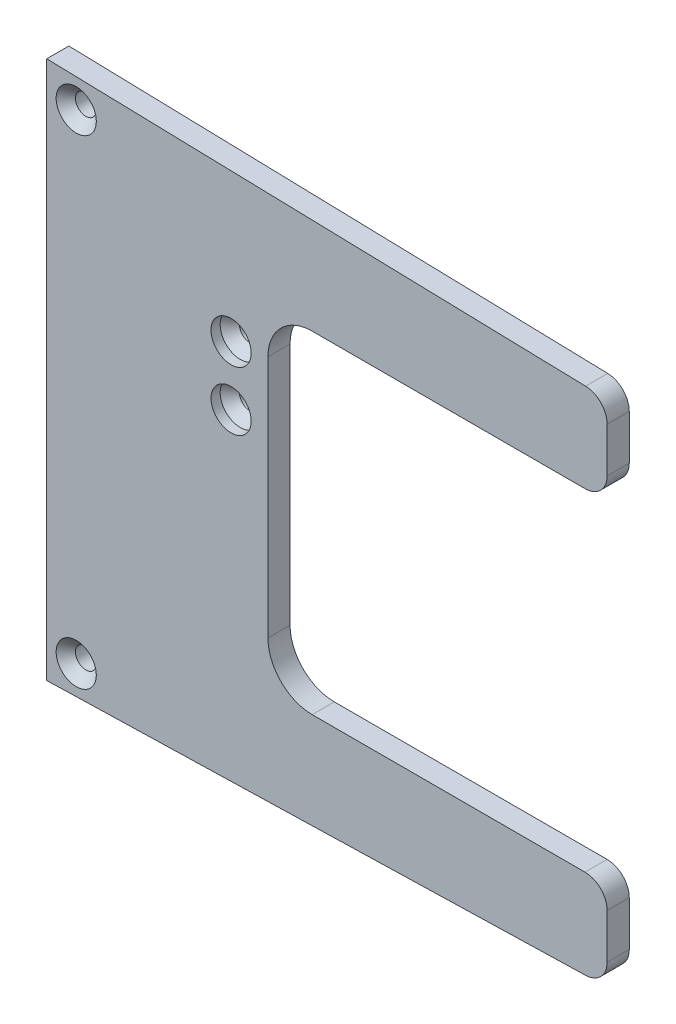
ISO-10303-21;
HEADER;
FILE_DESCRIPTION(('STEP AP214'),'2;1');
FILE_NAME('part.step','',(''),(''),'','','');
FILE_SCHEMA(('AUTOMOTIVE_DESIGN { 1 0 10303 214 1 1 1 1 }'));
ENDSEC;
DATA;
#1=APPLICATION_CONTEXT('core data for automotive mechanical design processes');
#2=APPLICATION_PROTOCOL_DEFINITION('international standard','automotive_design',2000,#1);
#3=PRODUCT_CONTEXT('',#1,'mechanical');
#4=PRODUCT('Part','Part','',(#3));
#5=PRODUCT_RELATED_PRODUCT_CATEGORY('part','',(#4));
#6=PRODUCT_DEFINITION_FORMATION('','',#4);
#7=PRODUCT_DEFINITION_CONTEXT('part definition',#1,'design');
#8=PRODUCT_DEFINITION('design','',#6,#7);
#9=PRODUCT_DEFINITION_SHAPE('','',#8);
#10=(LENGTH_UNIT() NAMED_UNIT(*) SI_UNIT(.MILLI.,.METRE.));
#11=(NAMED_UNIT(*) PLANE_ANGLE_UNIT() SI_UNIT($,.RADIAN.));
#12=(NAMED_UNIT(*) SI_UNIT($,.STERADIAN.) SOLID_ANGLE_UNIT());
#13=UNCERTAINTY_MEASURE_WITH_UNIT(LENGTH_MEASURE(1.E-05),#10,'distance_accuracy_value','');
#14=(GEOMETRIC_REPRESENTATION_CONTEXT(3) GLOBAL_UNCERTAINTY_ASSIGNED_CONTEXT((#13)) GLOBAL_UNIT_ASSIGNED_CONTEXT((#10,
#11,#12)) REPRESENTATION_CONTEXT('',''));
#15=CARTESIAN_POINT('',(0.,0.,0.));
#16=DIRECTION('',(0.,0.,1.));
#17=DIRECTION('',(1.,0.,0.));
#18=AXIS2_PLACEMENT_3D('',#15,#16,#17);
#19=CARTESIAN_POINT('',(-47.625,-115.91925,9.525));
#20=DIRECTION('',(1.,0.,0.));
#21=DIRECTION('',(0.,-1.,0.));
#22=AXIS2_PLACEMENT_3D('',#19,#20,#21);
#23=PLANE('',#22);
#24=DIRECTION('',(0.,1.,0.));
#25=VECTOR('',#24,1.);
#26=CARTESIAN_POINT('',(-47.625,-115.91925,0.));
#27=LINE('',#26,#25);
#28=CARTESIAN_POINT('',(-47.625,-115.91925,0.));
#29=VERTEX_POINT('',#28);
#30=CARTESIAN_POINT('',(-47.625,115.91925,0.));
#31=VERTEX_POINT('',#30);
#32=EDGE_CURVE('E168',#29,#31,#27,.T.);
#33=ORIENTED_EDGE('',*,*,#32,.F.);
#34=DIRECTION('',(0.,0.,-1.));
#35=VECTOR('',#34,1.);
#36=CARTESIAN_POINT('',(-47.625,-115.91925,9.525));
#37=LINE('',#36,#35);
#38=CARTESIAN_POINT('',(-47.625,-115.91925,9.525));
#39=VERTEX_POINT('',#38);
#40=EDGE_CURVE('E159',#39,#29,#37,.T.);
#41=ORIENTED_EDGE('',*,*,#40,.F.);
#42=DIRECTION('',(0.,1.,0.));
#43=VECTOR('',#42,1.);
#44=CARTESIAN_POINT('',(-47.625,-115.91925,9.525));
#45=LINE('',#44,#43);
#46=CARTESIAN_POINT('',(-47.625,115.91925,9.525));
#47=VERTEX_POINT('',#46);
#48=EDGE_CURVE('E142',#39,#47,#45,.T.);
#49=ORIENTED_EDGE('',*,*,#48,.T.);
#50=DIRECTION('',(0.,0.,-1.));
#51=VECTOR('',#50,1.);
#52=CARTESIAN_POINT('',(-47.625,115.91925,9.525));
#53=LINE('',#52,#51);
#54=EDGE_CURVE('E152',#47,#31,#53,.T.);
#55=ORIENTED_EDGE('',*,*,#54,.T.);
#56=EDGE_LOOP('',(#33,#41,#49,#55));
#57=FACE_BOUND('',#56,.T.);
#58=ADVANCED_FACE('F37',(#57),#23,.F.);
#59=CARTESIAN_POINT('',(47.625,-115.91925,9.525));
#60=DIRECTION('',(-1.,0.,0.));
#61=DIRECTION('',(0.,1.,0.));
#62=AXIS2_PLACEMENT_3D('',#59,#60,#61);
#63=PLANE('',#62);
#64=DIRECTION('',(0.,-1.,0.));
#65=VECTOR('',#64,1.);
#66=CARTESIAN_POINT('',(47.625,-115.91925,9.525));
#67=LINE('',#66,#65);
#68=CARTESIAN_POINT('',(47.625,52.4505871253568,9.525));
#69=VERTEX_POINT('',#68);
#70=CARTESIAN_POINT('',(47.625,-52.4505871253569,9.525));
#71=VERTEX_POINT('',#70);
#72=EDGE_CURVE('E162',#69,#71,#67,.T.);
#73=ORIENTED_EDGE('',*,*,#72,.T.);
#74=DIRECTION('',(0.,0.,1.));
#75=VECTOR('',#74,1.);
#76=CARTESIAN_POINT('',(47.625,-52.4505871253569,9.525));
#77=LINE('',#76,#75);
#78=CARTESIAN_POINT('',(47.625,-52.4505871253569,0.));
#79=VERTEX_POINT('',#78);
#80=EDGE_CURVE('E215',#79,#71,#77,.T.);
#81=ORIENTED_EDGE('',*,*,#80,.F.);
#82=DIRECTION('',(0.,-1.,0.));
#83=VECTOR('',#82,1.);
#84=CARTESIAN_POINT('',(47.625,-115.91925,0.));
#85=LINE('',#84,#83);
#86=CARTESIAN_POINT('',(47.625,52.4505871253568,0.));
#87=VERTEX_POINT('',#86);
#88=EDGE_CURVE('E163',#87,#79,#85,.T.);
#89=ORIENTED_EDGE('',*,*,#88,.F.);
#90=DIRECTION('',(0.,0.,1.));
#91=VECTOR('',#90,1.);
#92=CARTESIAN_POINT('',(47.625,52.4505871253569,9.525));
#93=LINE('',#92,#91);
#94=EDGE_CURVE('E218',#69,#87,#93,.F.);
#95=ORIENTED_EDGE('',*,*,#94,.F.);
#96=EDGE_LOOP('',(#73,#81,#89,#95));
#97=FACE_BOUND('',#96,.T.);
#98=ADVANCED_FACE('F309',(#97),#63,.F.);
#99=CARTESIAN_POINT('',(-47.625,115.91925,9.525));
#100=DIRECTION('',(0.,0.,1.));
#101=DIRECTION('',(1.,0.,0.));
#102=AXIS2_PLACEMENT_3D('',#99,#100,#101);
#103=PLANE('',#102);
#104=DIRECTION('',(-0.999657324975558,0.0261769483078661,0.));
#105=VECTOR('',#104,1.);
#106=CARTESIAN_POINT('',(47.625,113.425040970536,9.525));
#107=LINE('',#106,#105);
#108=CARTESIAN_POINT('',(184.399335432632,109.84347895022,9.525));
#109=VERTEX_POINT('',#108);
#110=EDGE_CURVE('E136',#109,#47,#107,.T.);
#111=ORIENTED_EDGE('',*,*,#110,.T.);
#112=ORIENTED_EDGE('',*,*,#48,.F.);
#113=DIRECTION('',(0.999657324975557,0.026176948307866,0.));
#114=VECTOR('',#113,1.);
#115=CARTESIAN_POINT('',(-47.625,-115.91925,9.525));
#116=LINE('',#115,#114);
#117=CARTESIAN_POINT('',(184.399335432632,-109.84347895022,9.525));
#118=VERTEX_POINT('',#117);
#119=EDGE_CURVE('E148',#39,#118,#116,.T.);
#120=ORIENTED_EDGE('',*,*,#119,.T.);
#121=CARTESIAN_POINT('',(184.15,-100.321742929828,9.52500000000001));
#122=DIRECTION('',(0.,0.,-1.));
#123=DIRECTION('',(1.,0.,0.));
#124=AXIS2_PLACEMENT_3D('',#121,#122,#123);
#125=CIRCLE('',#124,9.525);
#126=CARTESIAN_POINT('',(193.675,-100.321742929828,9.525));
#127=VERTEX_POINT('',#126);
#128=EDGE_CURVE('E177',#127,#118,#125,.T.);
#129=ORIENTED_EDGE('',*,*,#128,.F.);
#130=DIRECTION('',(0.,-1.,0.));
#131=VECTOR('',#130,1.);
#132=CARTESIAN_POINT('',(193.675,-109.600587125357,9.525));
#133=LINE('',#132,#131);
#134=CARTESIAN_POINT('',(193.675,-81.0255871253569,9.525));
#135=VERTEX_POINT('',#134);
#136=EDGE_CURVE('E232',#135,#127,#133,.T.);
#137=ORIENTED_EDGE('',*,*,#136,.F.);
#138=CARTESIAN_POINT('',(184.15,-81.0255871253569,9.52500000000001));
#139=DIRECTION('',(0.,0.,-1.));
#140=DIRECTION('',(1.,0.,0.));
#141=AXIS2_PLACEMENT_3D('',#138,#139,#140);
#142=CIRCLE('',#141,9.525);
#143=CARTESIAN_POINT('',(184.15,-71.5005871253569,9.525));
#144=VERTEX_POINT('',#143);
#145=EDGE_CURVE('E180',#144,#135,#142,.T.);
#146=ORIENTED_EDGE('',*,*,#145,.F.);
#147=DIRECTION('',(1.,0.,0.));
#148=VECTOR('',#147,1.);
#149=CARTESIAN_POINT('',(193.675,-71.5005871253569,9.525));
#150=LINE('',#149,#148);
#151=CARTESIAN_POINT('',(66.675,-71.5005871253569,9.525));
#152=VERTEX_POINT('',#151);
#153=EDGE_CURVE('E230',#152,#144,#150,.T.);
#154=ORIENTED_EDGE('',*,*,#153,.F.);
#155=CARTESIAN_POINT('',(66.675,-52.4505871253569,9.525));
#156=DIRECTION('',(0.,0.,-1.));
#157=DIRECTION('',(1.,0.,0.));
#158=AXIS2_PLACEMENT_3D('',#155,#156,#157);
#159=CIRCLE('',#158,19.05);
#160=EDGE_CURVE('E45',#71,#152,#159,.F.);
#161=ORIENTED_EDGE('',*,*,#160,.F.);
#162=ORIENTED_EDGE('',*,*,#72,.F.);
#163=CARTESIAN_POINT('',(66.675,52.4505871253569,9.52500000000001));
#164=DIRECTION('',(0.,0.,-1.));
#165=DIRECTION('',(1.,0.,0.));
#166=AXIS2_PLACEMENT_3D('',#163,#164,#165);
#167=CIRCLE('',#166,19.05);
#168=CARTESIAN_POINT('',(66.675,71.5005871253569,9.525));
#169=VERTEX_POINT('',#168);
#170=EDGE_CURVE('E222',#169,#69,#167,.F.);
#171=ORIENTED_EDGE('',*,*,#170,.F.);
#172=DIRECTION('',(-1.,0.,0.));
#173=VECTOR('',#172,1.);
#174=CARTESIAN_POINT('',(47.625,71.5005871253569,9.525));
#175=LINE('',#174,#173);
#176=CARTESIAN_POINT('',(184.15,71.5005871253569,9.525));
#177=VERTEX_POINT('',#176);
#178=EDGE_CURVE('E349',#177,#169,#175,.T.);
#179=ORIENTED_EDGE('',*,*,#178,.F.);
#180=CARTESIAN_POINT('',(184.15,81.0255871253569,9.52500000000001));
#181=DIRECTION('',(0.,0.,-1.));
#182=DIRECTION('',(1.,0.,0.));
#183=AXIS2_PLACEMENT_3D('',#180,#181,#182);
#184=CIRCLE('',#183,9.525);
#185=CARTESIAN_POINT('',(193.675,81.0255871253569,9.525));
#186=VERTEX_POINT('',#185);
#187=EDGE_CURVE('E183',#186,#177,#184,.T.);
#188=ORIENTED_EDGE('',*,*,#187,.F.);
#189=DIRECTION('',(0.,-1.,0.));
#190=VECTOR('',#189,1.);
#191=CARTESIAN_POINT('',(193.675,71.5005871253569,9.525));
#192=LINE('',#191,#190);
#193=CARTESIAN_POINT('',(193.675,100.321742929828,9.525));
#194=VERTEX_POINT('',#193);
#195=EDGE_CURVE('E352',#194,#186,#192,.T.);
#196=ORIENTED_EDGE('',*,*,#195,.F.);
#197=CARTESIAN_POINT('',(184.15,100.321742929828,9.525));
#198=DIRECTION('',(0.,0.,-1.));
#199=DIRECTION('',(1.,0.,0.));
#200=AXIS2_PLACEMENT_3D('',#197,#198,#199);
#201=CIRCLE('',#200,9.525);
#202=EDGE_CURVE('E146',#109,#194,#201,.T.);
#203=ORIENTED_EDGE('',*,*,#202,.F.);
#204=EDGE_LOOP('',(#111,#112,#120,#129,#137,#146,#154,#161,#162,#171,#179,#188,#196,#203));
#205=FACE_BOUND('',#204,.T.);
#206=CARTESIAN_POINT('',(-34.925,-103.21925,9.525));
#207=DIRECTION('',(0.,0.,-1.));
#208=DIRECTION('',(1.,0.,0.));
#209=AXIS2_PLACEMENT_3D('',#206,#207,#208);
#210=CIRCLE('',#209,8.65);
#211=CARTESIAN_POINT('',(-26.275,-103.21925,9.525));
#212=VERTEX_POINT('',#211);
#213=EDGE_CURVE('E250',#212,#212,#210,.T.);
#214=ORIENTED_EDGE('',*,*,#213,.T.);
#215=EDGE_LOOP('',(#214));
#216=FACE_BOUND('',#215,.T.);
#217=CARTESIAN_POINT('',(-34.925,103.21925,9.525));
#218=DIRECTION('',(0.,0.,-1.));
#219=DIRECTION('',(1.,0.,0.));
#220=AXIS2_PLACEMENT_3D('',#217,#218,#219);
#221=CIRCLE('',#220,8.65);
#222=CARTESIAN_POINT('',(-26.275,103.21925,9.525));
#223=VERTEX_POINT('',#222);
#224=EDGE_CURVE('E259',#223,#223,#221,.T.);
#225=ORIENTED_EDGE('',*,*,#224,.T.);
#226=EDGE_LOOP('',(#225));
#227=FACE_BOUND('',#226,.T.);
#228=CARTESIAN_POINT('',(31.75,50.15865,9.525));
#229=DIRECTION('',(0.,0.,-1.));
#230=DIRECTION('',(1.,0.,0.));
#231=AXIS2_PLACEMENT_3D('',#228,#229,#230);
#232=CIRCLE('',#231,8.65);
#233=CARTESIAN_POINT('',(40.4,50.15865,9.525));
#234=VERTEX_POINT('',#233);
#235=EDGE_CURVE('E277',#234,#234,#232,.T.);
#236=ORIENTED_EDGE('',*,*,#235,.T.);
#237=EDGE_LOOP('',(#236));
#238=FACE_BOUND('',#237,.T.);
#239=CARTESIAN_POINT('',(31.75,24.75865,9.525));
#240=DIRECTION('',(0.,0.,-1.));
#241=DIRECTION('',(1.,0.,0.));
#242=AXIS2_PLACEMENT_3D('',#239,#240,#241);
#243=CIRCLE('',#242,8.65);
#244=CARTESIAN_POINT('',(40.4,24.75865,9.525));
#245=VERTEX_POINT('',#244);
#246=EDGE_CURVE('E171',#245,#245,#243,.T.);
#247=ORIENTED_EDGE('',*,*,#246,.T.);
#248=EDGE_LOOP('',(#247));
#249=FACE_BOUND('',#248,.T.);
#250=ADVANCED_FACE('F138',(#205,#216,#227,#238,#249),#103,.T.);
#251=CARTESIAN_POINT('',(-47.625,115.91925,0.));
#252=DIRECTION('',(0.,0.,1.));
#253=DIRECTION('',(1.,0.,0.));
#254=AXIS2_PLACEMENT_3D('',#251,#252,#253);
#255=PLANE('',#254);
#256=CARTESIAN_POINT('',(-34.925,-103.21925,0.));
#257=DIRECTION('',(0.,0.,-1.));
#258=DIRECTION('',(1.,0.,0.));
#259=AXIS2_PLACEMENT_3D('',#256,#257,#258);
#260=CIRCLE('',#259,4.49999999999999);
#261=CARTESIAN_POINT('',(-30.425,-103.21925,0.));
#262=VERTEX_POINT('',#261);
#263=EDGE_CURVE('E256',#262,#262,#260,.T.);
#264=ORIENTED_EDGE('',*,*,#263,.F.);
#265=EDGE_LOOP('',(#264));
#266=FACE_BOUND('',#265,.T.);
#267=CARTESIAN_POINT('',(-34.925,103.21925,0.));
#268=DIRECTION('',(0.,0.,-1.));
#269=DIRECTION('',(1.,0.,0.));
#270=AXIS2_PLACEMENT_3D('',#267,#268,#269);
#271=CIRCLE('',#270,4.49999999999999);
#272=CARTESIAN_POINT('',(-30.425,103.21925,0.));
#273=VERTEX_POINT('',#272);
#274=EDGE_CURVE('E265',#273,#273,#271,.T.);
#275=ORIENTED_EDGE('',*,*,#274,.F.);
#276=EDGE_LOOP('',(#275));
#277=FACE_BOUND('',#276,.T.);
#278=CARTESIAN_POINT('',(31.75,50.15865,0.));
#279=DIRECTION('',(0.,0.,-1.));
#280=DIRECTION('',(1.,0.,0.));
#281=AXIS2_PLACEMENT_3D('',#278,#279,#280);
#282=CIRCLE('',#281,4.5);
#283=CARTESIAN_POINT('',(36.25,50.15865,0.));
#284=VERTEX_POINT('',#283);
#285=EDGE_CURVE('E268',#284,#284,#282,.T.);
#286=ORIENTED_EDGE('',*,*,#285,.F.);
#287=EDGE_LOOP('',(#286));
#288=FACE_BOUND('',#287,.T.);
#289=CARTESIAN_POINT('',(31.75,24.75865,0.));
#290=DIRECTION('',(0.,0.,-1.));
#291=DIRECTION('',(1.,0.,0.));
#292=AXIS2_PLACEMENT_3D('',#289,#290,#291);
#293=CIRCLE('',#292,4.5);
#294=CARTESIAN_POINT('',(36.25,24.75865,0.));
#295=VERTEX_POINT('',#294);
#296=EDGE_CURVE('E280',#295,#295,#293,.T.);
#297=ORIENTED_EDGE('',*,*,#296,.F.);
#298=EDGE_LOOP('',(#297));
#299=FACE_BOUND('',#298,.T.);
#300=DIRECTION('',(0.,1.,0.));
#301=VECTOR('',#300,1.);
#302=CARTESIAN_POINT('',(193.675,71.5005871253569,0.));
#303=LINE('',#302,#301);
#304=CARTESIAN_POINT('',(193.675,81.0255871253569,0.));
#305=VERTEX_POINT('',#304);
#306=CARTESIAN_POINT('',(193.675,100.321742929828,0.));
#307=VERTEX_POINT('',#306);
#308=EDGE_CURVE('E239',#305,#307,#303,.T.);
#309=ORIENTED_EDGE('',*,*,#308,.F.);
#310=CARTESIAN_POINT('',(184.15,81.0255871253569,0.));
#311=DIRECTION('',(0.,0.,-1.));
#312=DIRECTION('',(1.,0.,0.));
#313=AXIS2_PLACEMENT_3D('',#310,#311,#312);
#314=CIRCLE('',#313,9.525);
#315=CARTESIAN_POINT('',(184.15,71.5005871253569,0.));
#316=VERTEX_POINT('',#315);
#317=EDGE_CURVE('E197',#316,#305,#314,.F.);
#318=ORIENTED_EDGE('',*,*,#317,.F.);
#319=DIRECTION('',(1.,0.,0.));
#320=VECTOR('',#319,1.);
#321=CARTESIAN_POINT('',(47.625,71.5005871253569,0.));
#322=LINE('',#321,#320);
#323=CARTESIAN_POINT('',(66.675,71.5005871253569,0.));
#324=VERTEX_POINT('',#323);
#325=EDGE_CURVE('E233',#324,#316,#322,.T.);
#326=ORIENTED_EDGE('',*,*,#325,.F.);
#327=CARTESIAN_POINT('',(66.675,52.4505871253569,0.));
#328=DIRECTION('',(0.,0.,-1.));
#329=DIRECTION('',(1.,0.,0.));
#330=AXIS2_PLACEMENT_3D('',#327,#328,#329);
#331=CIRCLE('',#330,19.05);
#332=EDGE_CURVE('E224',#87,#324,#331,.T.);
#333=ORIENTED_EDGE('',*,*,#332,.F.);
#334=ORIENTED_EDGE('',*,*,#88,.T.);
#335=CARTESIAN_POINT('',(66.675,-52.4505871253569,0.));
#336=DIRECTION('',(0.,0.,-1.));
#337=DIRECTION('',(1.,0.,0.));
#338=AXIS2_PLACEMENT_3D('',#335,#336,#337);
#339=CIRCLE('',#338,19.05);
#340=CARTESIAN_POINT('',(66.675,-71.5005871253569,0.));
#341=VERTEX_POINT('',#340);
#342=EDGE_CURVE('E11',#341,#79,#339,.T.);
#343=ORIENTED_EDGE('',*,*,#342,.F.);
#344=DIRECTION('',(-1.,0.,0.));
#345=VECTOR('',#344,1.);
#346=CARTESIAN_POINT('',(193.675,-71.5005871253569,0.));
#347=LINE('',#346,#345);
#348=CARTESIAN_POINT('',(184.15,-71.5005871253569,0.));
#349=VERTEX_POINT('',#348);
#350=EDGE_CURVE('E244',#349,#341,#347,.T.);
#351=ORIENTED_EDGE('',*,*,#350,.F.);
#352=CARTESIAN_POINT('',(184.15,-81.0255871253569,0.));
#353=DIRECTION('',(0.,0.,-1.));
#354=DIRECTION('',(1.,0.,0.));
#355=AXIS2_PLACEMENT_3D('',#352,#353,#354);
#356=CIRCLE('',#355,9.525);
#357=CARTESIAN_POINT('',(193.675,-81.0255871253569,0.));
#358=VERTEX_POINT('',#357);
#359=EDGE_CURVE('E194',#358,#349,#356,.F.);
#360=ORIENTED_EDGE('',*,*,#359,.F.);
#361=DIRECTION('',(0.,1.,0.));
#362=VECTOR('',#361,1.);
#363=CARTESIAN_POINT('',(193.675,-109.600587125357,0.));
#364=LINE('',#363,#362);
#365=CARTESIAN_POINT('',(193.675,-100.321742929828,0.));
#366=VERTEX_POINT('',#365);
#367=EDGE_CURVE('E236',#366,#358,#364,.T.);
#368=ORIENTED_EDGE('',*,*,#367,.F.);
#369=CARTESIAN_POINT('',(184.15,-100.321742929828,0.));
#370=DIRECTION('',(0.,0.,-1.));
#371=DIRECTION('',(1.,0.,0.));
#372=AXIS2_PLACEMENT_3D('',#369,#370,#371);
#373=CIRCLE('',#372,9.525);
#374=CARTESIAN_POINT('',(184.399335432632,-109.84347895022,0.));
#375=VERTEX_POINT('',#374);
#376=EDGE_CURVE('E191',#375,#366,#373,.F.);
#377=ORIENTED_EDGE('',*,*,#376,.F.);
#378=DIRECTION('',(-0.999657324975558,-0.026176948307866,0.));
#379=VECTOR('',#378,1.);
#380=CARTESIAN_POINT('',(-47.625,-115.91925,0.));
#381=LINE('',#380,#379);
#382=EDGE_CURVE('E248',#375,#29,#381,.T.);
#383=ORIENTED_EDGE('',*,*,#382,.T.);
#384=ORIENTED_EDGE('',*,*,#32,.T.);
#385=DIRECTION('',(0.999657324975558,-0.0261769483078661,0.));
#386=VECTOR('',#385,1.);
#387=CARTESIAN_POINT('',(47.625,113.425040970536,0.));
#388=LINE('',#387,#386);
#389=CARTESIAN_POINT('',(184.399335432632,109.84347895022,0.));
#390=VERTEX_POINT('',#389);
#391=EDGE_CURVE('E149',#31,#390,#388,.T.);
#392=ORIENTED_EDGE('',*,*,#391,.T.);
#393=CARTESIAN_POINT('',(184.15,100.321742929828,0.));
#394=DIRECTION('',(0.,0.,-1.));
#395=DIRECTION('',(1.,0.,0.));
#396=AXIS2_PLACEMENT_3D('',#393,#394,#395);
#397=CIRCLE('',#396,9.525);
#398=EDGE_CURVE('E200',#307,#390,#397,.F.);
#399=ORIENTED_EDGE('',*,*,#398,.F.);
#400=EDGE_LOOP('',(#309,#318,#326,#333,#334,#343,#351,#360,#368,#377,#383,#384,#392,#399));
#401=FACE_BOUND('',#400,.T.);
#402=ADVANCED_FACE('F296',(#266,#277,#288,#299,#401),#255,.F.);
#403=CARTESIAN_POINT('',(31.75,24.75865,9.525));
#404=DIRECTION('',(0.,0.,1.));
#405=DIRECTION('',(1.,0.,0.));
#406=AXIS2_PLACEMENT_3D('',#403,#404,#405);
#407=CYLINDRICAL_SURFACE('',#406,8.65);
#408=CARTESIAN_POINT('',(31.75,24.75865,5.5626));
#409=DIRECTION('',(0.,0.,-1.));
#410=DIRECTION('',(1.,0.,0.));
#411=AXIS2_PLACEMENT_3D('',#408,#409,#410);
#412=CIRCLE('',#411,8.65);
#413=CARTESIAN_POINT('',(40.4,24.75865,5.5626));
#414=VERTEX_POINT('',#413);
#415=EDGE_CURVE('E285',#414,#414,#412,.T.);
#416=ORIENTED_EDGE('',*,*,#415,.T.);
#417=EDGE_LOOP('',(#416));
#418=FACE_BOUND('',#417,.T.);
#419=ORIENTED_EDGE('',*,*,#246,.F.);
#420=EDGE_LOOP('',(#419));
#421=FACE_BOUND('',#420,.T.);
#422=ADVANCED_FACE('F293',(#418,#421),#407,.F.);
#423=CARTESIAN_POINT('',(31.75,24.75865,5.5626));
#424=DIRECTION('',(0.,0.,1.));
#425=DIRECTION('',(1.,0.,0.));
#426=AXIS2_PLACEMENT_3D('',#423,#424,#425);
#427=CONICAL_SURFACE('',#426,8.65,0.785398163397449);
#428=CARTESIAN_POINT('',(31.75,24.75865,1.41260000000001));
#429=DIRECTION('',(0.,0.,-1.));
#430=DIRECTION('',(1.,0.,0.));
#431=AXIS2_PLACEMENT_3D('',#428,#429,#430);
#432=CIRCLE('',#431,4.5);
#433=CARTESIAN_POINT('',(36.25,24.75865,1.41260000000001));
#434=VERTEX_POINT('',#433);
#435=EDGE_CURVE('E283',#434,#434,#432,.T.);
#436=ORIENTED_EDGE('',*,*,#435,.T.);
#437=EDGE_LOOP('',(#436));
#438=FACE_BOUND('',#437,.T.);
#439=ORIENTED_EDGE('',*,*,#415,.F.);
#440=EDGE_LOOP('',(#439));
#441=FACE_BOUND('',#440,.T.);
#442=ADVANCED_FACE('F295',(#438,#441),#427,.F.);
#443=CARTESIAN_POINT('',(31.75,24.75865,9.525));
#444=DIRECTION('',(0.,0.,1.));
#445=DIRECTION('',(1.,0.,0.));
#446=AXIS2_PLACEMENT_3D('',#443,#444,#445);
#447=CYLINDRICAL_SURFACE('',#446,4.5);
#448=ORIENTED_EDGE('',*,*,#296,.T.);
#449=EDGE_LOOP('',(#448));
#450=FACE_BOUND('',#449,.T.);
#451=ORIENTED_EDGE('',*,*,#435,.F.);
#452=EDGE_LOOP('',(#451));
#453=FACE_BOUND('',#452,.T.);
#454=ADVANCED_FACE('F302',(#450,#453),#447,.F.);
#455=CARTESIAN_POINT('',(31.75,50.15865,9.525));
#456=DIRECTION('',(0.,0.,1.));
#457=DIRECTION('',(1.,0.,0.));
#458=AXIS2_PLACEMENT_3D('',#455,#456,#457);
#459=CYLINDRICAL_SURFACE('',#458,8.65);
#460=CARTESIAN_POINT('',(31.75,50.15865,5.5626));
#461=DIRECTION('',(0.,0.,-1.));
#462=DIRECTION('',(1.,0.,0.));
#463=AXIS2_PLACEMENT_3D('',#460,#461,#462);
#464=CIRCLE('',#463,8.65);
#465=CARTESIAN_POINT('',(40.4,50.15865,5.5626));
#466=VERTEX_POINT('',#465);
#467=EDGE_CURVE('E274',#466,#466,#464,.T.);
#468=ORIENTED_EDGE('',*,*,#467,.T.);
#469=EDGE_LOOP('',(#468));
#470=FACE_BOUND('',#469,.T.);
#471=ORIENTED_EDGE('',*,*,#235,.F.);
#472=EDGE_LOOP('',(#471));
#473=FACE_BOUND('',#472,.T.);
#474=ADVANCED_FACE('F410',(#470,#473),#459,.F.);
#475=CARTESIAN_POINT('',(31.75,50.15865,5.5626));
#476=DIRECTION('',(0.,0.,1.));
#477=DIRECTION('',(1.,0.,0.));
#478=AXIS2_PLACEMENT_3D('',#475,#476,#477);
#479=CONICAL_SURFACE('',#478,8.65,0.785398163397449);
#480=CARTESIAN_POINT('',(31.75,50.15865,1.41260000000001));
#481=DIRECTION('',(0.,0.,-1.));
#482=DIRECTION('',(1.,0.,0.));
#483=AXIS2_PLACEMENT_3D('',#480,#481,#482);
#484=CIRCLE('',#483,4.5);
#485=CARTESIAN_POINT('',(36.25,50.15865,1.41260000000001));
#486=VERTEX_POINT('',#485);
#487=EDGE_CURVE('E271',#486,#486,#484,.T.);
#488=ORIENTED_EDGE('',*,*,#487,.T.);
#489=EDGE_LOOP('',(#488));
#490=FACE_BOUND('',#489,.T.);
#491=ORIENTED_EDGE('',*,*,#467,.F.);
#492=EDGE_LOOP('',(#491));
#493=FACE_BOUND('',#492,.T.);
#494=ADVANCED_FACE('F406',(#490,#493),#479,.F.);
#495=CARTESIAN_POINT('',(31.75,50.15865,9.525));
#496=DIRECTION('',(0.,0.,1.));
#497=DIRECTION('',(1.,0.,0.));
#498=AXIS2_PLACEMENT_3D('',#495,#496,#497);
#499=CYLINDRICAL_SURFACE('',#498,4.5);
#500=ORIENTED_EDGE('',*,*,#285,.T.);
#501=EDGE_LOOP('',(#500));
#502=FACE_BOUND('',#501,.T.);
#503=ORIENTED_EDGE('',*,*,#487,.F.);
#504=EDGE_LOOP('',(#503));
#505=FACE_BOUND('',#504,.T.);
#506=ADVANCED_FACE('F402',(#502,#505),#499,.F.);
#507=CARTESIAN_POINT('',(-34.925,103.21925,9.525));
#508=DIRECTION('',(0.,0.,1.));
#509=DIRECTION('',(1.,0.,0.));
#510=AXIS2_PLACEMENT_3D('',#507,#508,#509);
#511=CYLINDRICAL_SURFACE('',#510,4.49999999999999);
#512=ORIENTED_EDGE('',*,*,#274,.T.);
#513=EDGE_LOOP('',(#512));
#514=FACE_BOUND('',#513,.T.);
#515=CARTESIAN_POINT('',(-34.925,103.21925,5.375));
#516=DIRECTION('',(0.,0.,-1.));
#517=DIRECTION('',(1.,0.,0.));
#518=AXIS2_PLACEMENT_3D('',#515,#516,#517);
#519=CIRCLE('',#518,4.5);
#520=CARTESIAN_POINT('',(-30.425,103.21925,5.375));
#521=VERTEX_POINT('',#520);
#522=EDGE_CURVE('E262',#521,#521,#519,.T.);
#523=ORIENTED_EDGE('',*,*,#522,.F.);
#524=EDGE_LOOP('',(#523));
#525=FACE_BOUND('',#524,.T.);
#526=ADVANCED_FACE('F398',(#514,#525),#511,.F.);
#527=CARTESIAN_POINT('',(-34.925,103.21925,9.525));
#528=DIRECTION('',(0.,0.,1.));
#529=DIRECTION('',(1.,0.,0.));
#530=AXIS2_PLACEMENT_3D('',#527,#528,#529);
#531=CONICAL_SURFACE('',#530,8.65,0.785398163397448);
#532=ORIENTED_EDGE('',*,*,#522,.T.);
#533=EDGE_LOOP('',(#532));
#534=FACE_BOUND('',#533,.T.);
#535=ORIENTED_EDGE('',*,*,#224,.F.);
#536=EDGE_LOOP('',(#535));
#537=FACE_BOUND('',#536,.T.);
#538=ADVANCED_FACE('F394',(#534,#537),#531,.F.);
#539=CARTESIAN_POINT('',(-34.925,-103.21925,9.525));
#540=DIRECTION('',(0.,0.,1.));
#541=DIRECTION('',(1.,0.,0.));
#542=AXIS2_PLACEMENT_3D('',#539,#540,#541);
#543=CYLINDRICAL_SURFACE('',#542,4.49999999999999);
#544=ORIENTED_EDGE('',*,*,#263,.T.);
#545=EDGE_LOOP('',(#544));
#546=FACE_BOUND('',#545,.T.);
#547=CARTESIAN_POINT('',(-34.925,-103.21925,5.375));
#548=DIRECTION('',(0.,0.,-1.));
#549=DIRECTION('',(1.,0.,0.));
#550=AXIS2_PLACEMENT_3D('',#547,#548,#549);
#551=CIRCLE('',#550,4.5);
#552=CARTESIAN_POINT('',(-30.425,-103.21925,5.375));
#553=VERTEX_POINT('',#552);
#554=EDGE_CURVE('E253',#553,#553,#551,.T.);
#555=ORIENTED_EDGE('',*,*,#554,.F.);
#556=EDGE_LOOP('',(#555));
#557=FACE_BOUND('',#556,.T.);
#558=ADVANCED_FACE('F390',(#546,#557),#543,.F.);
#559=CARTESIAN_POINT('',(-34.925,-103.21925,9.525));
#560=DIRECTION('',(0.,0.,1.));
#561=DIRECTION('',(1.,0.,0.));
#562=AXIS2_PLACEMENT_3D('',#559,#560,#561);
#563=CONICAL_SURFACE('',#562,8.65,0.785398163397448);
#564=ORIENTED_EDGE('',*,*,#554,.T.);
#565=EDGE_LOOP('',(#564));
#566=FACE_BOUND('',#565,.T.);
#567=ORIENTED_EDGE('',*,*,#213,.F.);
#568=EDGE_LOOP('',(#567));
#569=FACE_BOUND('',#568,.T.);
#570=ADVANCED_FACE('F387',(#566,#569),#563,.F.);
#571=CARTESIAN_POINT('',(-47.625,-115.91925,-0.00100000000000447));
#572=DIRECTION('',(-0.026176948307866,0.999657324975557,0.));
#573=DIRECTION('',(0.999657324975558,0.026176948307866,0.));
#574=AXIS2_PLACEMENT_3D('',#571,#572,#573);
#575=PLANE('',#574);
#576=ORIENTED_EDGE('',*,*,#119,.F.);
#577=ORIENTED_EDGE('',*,*,#40,.T.);
#578=ORIENTED_EDGE('',*,*,#382,.F.);
#579=DIRECTION('',(0.,0.,1.));
#580=VECTOR('',#579,1.);
#581=CARTESIAN_POINT('',(184.399335432632,-109.84347895022,0.));
#582=LINE('',#581,#580);
#583=EDGE_CURVE('E211',#118,#375,#582,.F.);
#584=ORIENTED_EDGE('',*,*,#583,.F.);
#585=EDGE_LOOP('',(#576,#577,#578,#584));
#586=FACE_BOUND('',#585,.T.);
#587=ADVANCED_FACE('F365',(#586),#575,.F.);
#588=CARTESIAN_POINT('',(47.625,113.425040970536,-0.00100000000000447));
#589=DIRECTION('',(-0.0261769483078661,-0.999657324975557,0.));
#590=DIRECTION('',(-0.999657324975558,0.0261769483078661,0.));
#591=AXIS2_PLACEMENT_3D('',#588,#589,#590);
#592=PLANE('',#591);
#593=ORIENTED_EDGE('',*,*,#391,.F.);
#594=ORIENTED_EDGE('',*,*,#54,.F.);
#595=ORIENTED_EDGE('',*,*,#110,.F.);
#596=DIRECTION('',(0.,0.,1.));
#597=VECTOR('',#596,1.);
#598=CARTESIAN_POINT('',(184.399335432632,109.84347895022,9.525));
#599=LINE('',#598,#597);
#600=EDGE_CURVE('E158',#390,#109,#599,.T.);
#601=ORIENTED_EDGE('',*,*,#600,.F.);
#602=EDGE_LOOP('',(#593,#594,#595,#601));
#603=FACE_BOUND('',#602,.T.);
#604=ADVANCED_FACE('F153',(#603),#592,.F.);
#605=CARTESIAN_POINT('',(193.675,-109.600587125357,-151.948222530626));
#606=DIRECTION('',(1.,0.,0.));
#607=DIRECTION('',(0.,0.,-1.));
#608=AXIS2_PLACEMENT_3D('',#605,#606,#607);
#609=PLANE('',#608);
#610=ORIENTED_EDGE('',*,*,#136,.T.);
#611=DIRECTION('',(0.,0.,1.));
#612=VECTOR('',#611,1.);
#613=CARTESIAN_POINT('',(193.675,-100.321742929828,9.52500000000001));
#614=LINE('',#613,#612);
#615=EDGE_CURVE('E207',#366,#127,#614,.T.);
#616=ORIENTED_EDGE('',*,*,#615,.F.);
#617=ORIENTED_EDGE('',*,*,#367,.T.);
#618=DIRECTION('',(0.,0.,1.));
#619=VECTOR('',#618,1.);
#620=CARTESIAN_POINT('',(193.675,-81.0255871253569,-151.948222530626));
#621=LINE('',#620,#619);
#622=EDGE_CURVE('E209',#135,#358,#621,.F.);
#623=ORIENTED_EDGE('',*,*,#622,.F.);
#624=EDGE_LOOP('',(#610,#616,#617,#623));
#625=FACE_BOUND('',#624,.T.);
#626=ADVANCED_FACE('F360',(#625),#609,.T.);
#627=CARTESIAN_POINT('',(193.675,-71.5005871253569,-151.948222530626));
#628=DIRECTION('',(0.,1.,0.));
#629=DIRECTION('',(1.,0.,0.));
#630=AXIS2_PLACEMENT_3D('',#627,#628,#629);
#631=PLANE('',#630);
#632=ORIENTED_EDGE('',*,*,#153,.T.);
#633=DIRECTION('',(0.,0.,1.));
#634=VECTOR('',#633,1.);
#635=CARTESIAN_POINT('',(184.15,-71.5005871253569,-151.948222530626));
#636=LINE('',#635,#634);
#637=EDGE_CURVE('E205',#349,#144,#636,.T.);
#638=ORIENTED_EDGE('',*,*,#637,.F.);
#639=ORIENTED_EDGE('',*,*,#350,.T.);
#640=DIRECTION('',(0.,0.,1.));
#641=VECTOR('',#640,1.);
#642=CARTESIAN_POINT('',(66.675,-71.5005871253569,-151.948222530626));
#643=LINE('',#642,#641);
#644=EDGE_CURVE('E52',#152,#341,#643,.F.);
#645=ORIENTED_EDGE('',*,*,#644,.F.);
#646=EDGE_LOOP('',(#632,#638,#639,#645));
#647=FACE_BOUND('',#646,.T.);
#648=ADVANCED_FACE('F357',(#647),#631,.T.);
#649=CARTESIAN_POINT('',(47.625,71.5005871253569,-151.948222530626));
#650=DIRECTION('',(0.,-1.,0.));
#651=DIRECTION('',(0.,0.,1.));
#652=AXIS2_PLACEMENT_3D('',#649,#650,#651);
#653=PLANE('',#652);
#654=ORIENTED_EDGE('',*,*,#325,.T.);
#655=DIRECTION('',(0.,0.,1.));
#656=VECTOR('',#655,1.);
#657=CARTESIAN_POINT('',(184.15,71.5005871253569,-151.948222530626));
#658=LINE('',#657,#656);
#659=EDGE_CURVE('E203',#177,#316,#658,.F.);
#660=ORIENTED_EDGE('',*,*,#659,.F.);
#661=ORIENTED_EDGE('',*,*,#178,.T.);
#662=DIRECTION('',(0.,0.,1.));
#663=VECTOR('',#662,1.);
#664=CARTESIAN_POINT('',(66.675,71.5005871253569,-151.948222530626));
#665=LINE('',#664,#663);
#666=EDGE_CURVE('E213',#324,#169,#665,.T.);
#667=ORIENTED_EDGE('',*,*,#666,.F.);
#668=EDGE_LOOP('',(#654,#660,#661,#667));
#669=FACE_BOUND('',#668,.T.);
#670=ADVANCED_FACE('F347',(#669),#653,.T.);
#671=CARTESIAN_POINT('',(193.675,71.5005871253569,-151.948222530626));
#672=DIRECTION('',(1.,0.,0.));
#673=DIRECTION('',(0.,-1.,0.));
#674=AXIS2_PLACEMENT_3D('',#671,#672,#673);
#675=PLANE('',#674);
#676=ORIENTED_EDGE('',*,*,#195,.T.);
#677=DIRECTION('',(0.,0.,1.));
#678=VECTOR('',#677,1.);
#679=CARTESIAN_POINT('',(193.675,81.0255871253569,-151.948222530626));
#680=LINE('',#679,#678);
#681=EDGE_CURVE('E187',#305,#186,#680,.T.);
#682=ORIENTED_EDGE('',*,*,#681,.F.);
#683=ORIENTED_EDGE('',*,*,#308,.T.);
#684=DIRECTION('',(0.,0.,1.));
#685=VECTOR('',#684,1.);
#686=CARTESIAN_POINT('',(193.675,100.321742929828,0.));
#687=LINE('',#686,#685);
#688=EDGE_CURVE('E189',#194,#307,#687,.F.);
#689=ORIENTED_EDGE('',*,*,#688,.F.);
#690=EDGE_LOOP('',(#676,#682,#683,#689));
#691=FACE_BOUND('',#690,.T.);
#692=ADVANCED_FACE('F321',(#691),#675,.T.);
#693=CARTESIAN_POINT('',(184.15,100.321742929828,-0.00100000000000447));
#694=DIRECTION('',(0.,0.,-1.));
#695=DIRECTION('',(-1.,0.,0.));
#696=AXIS2_PLACEMENT_3D('',#693,#694,#695);
#697=CYLINDRICAL_SURFACE('',#696,9.525);
#698=ORIENTED_EDGE('',*,*,#398,.T.);
#699=ORIENTED_EDGE('',*,*,#600,.T.);
#700=ORIENTED_EDGE('',*,*,#202,.T.);
#701=ORIENTED_EDGE('',*,*,#688,.T.);
#702=EDGE_LOOP('',(#698,#699,#700,#701));
#703=FACE_BOUND('',#702,.T.);
#704=ADVANCED_FACE('F317',(#703),#697,.T.);
#705=CARTESIAN_POINT('',(184.15,81.0255871253569,-151.948222530626));
#706=DIRECTION('',(0.,0.,1.));
#707=DIRECTION('',(1.,0.,0.));
#708=AXIS2_PLACEMENT_3D('',#705,#706,#707);
#709=CYLINDRICAL_SURFACE('',#708,9.525);
#710=ORIENTED_EDGE('',*,*,#317,.T.);
#711=ORIENTED_EDGE('',*,*,#681,.T.);
#712=ORIENTED_EDGE('',*,*,#187,.T.);
#713=ORIENTED_EDGE('',*,*,#659,.T.);
#714=EDGE_LOOP('',(#710,#711,#712,#713));
#715=FACE_BOUND('',#714,.T.);
#716=ADVANCED_FACE('F320',(#715),#709,.T.);
#717=CARTESIAN_POINT('',(184.15,-81.0255871253569,-151.948222530626));
#718=DIRECTION('',(0.,0.,1.));
#719=DIRECTION('',(1.,0.,0.));
#720=AXIS2_PLACEMENT_3D('',#717,#718,#719);
#721=CYLINDRICAL_SURFACE('',#720,9.525);
#722=ORIENTED_EDGE('',*,*,#359,.T.);
#723=ORIENTED_EDGE('',*,*,#637,.T.);
#724=ORIENTED_EDGE('',*,*,#145,.T.);
#725=ORIENTED_EDGE('',*,*,#622,.T.);
#726=EDGE_LOOP('',(#722,#723,#724,#725));
#727=FACE_BOUND('',#726,.T.);
#728=ADVANCED_FACE('F325',(#727),#721,.T.);
#729=CARTESIAN_POINT('',(184.15,-100.321742929828,-151.948222530626));
#730=DIRECTION('',(0.,0.,-1.));
#731=DIRECTION('',(-1.,0.,0.));
#732=AXIS2_PLACEMENT_3D('',#729,#730,#731);
#733=CYLINDRICAL_SURFACE('',#732,9.525);
#734=ORIENTED_EDGE('',*,*,#376,.T.);
#735=ORIENTED_EDGE('',*,*,#615,.T.);
#736=ORIENTED_EDGE('',*,*,#128,.T.);
#737=ORIENTED_EDGE('',*,*,#583,.T.);
#738=EDGE_LOOP('',(#734,#735,#736,#737));
#739=FACE_BOUND('',#738,.T.);
#740=ADVANCED_FACE('F329',(#739),#733,.T.);
#741=CARTESIAN_POINT('',(66.675,52.4505871253569,-151.948222530626));
#742=DIRECTION('',(0.,0.,1.));
#743=DIRECTION('',(1.,0.,0.));
#744=AXIS2_PLACEMENT_3D('',#741,#742,#743);
#745=CYLINDRICAL_SURFACE('',#744,19.05);
#746=ORIENTED_EDGE('',*,*,#332,.T.);
#747=ORIENTED_EDGE('',*,*,#666,.T.);
#748=ORIENTED_EDGE('',*,*,#170,.T.);
#749=ORIENTED_EDGE('',*,*,#94,.T.);
#750=EDGE_LOOP('',(#746,#747,#748,#749));
#751=FACE_BOUND('',#750,.T.);
#752=ADVANCED_FACE('F332',(#751),#745,.F.);
#753=CARTESIAN_POINT('',(66.675,-52.4505871253569,9.525));
#754=DIRECTION('',(0.,0.,1.));
#755=DIRECTION('',(1.,0.,0.));
#756=AXIS2_PLACEMENT_3D('',#753,#754,#755);
#757=CYLINDRICAL_SURFACE('',#756,19.05);
#758=ORIENTED_EDGE('',*,*,#342,.T.);
#759=ORIENTED_EDGE('',*,*,#80,.T.);
#760=ORIENTED_EDGE('',*,*,#160,.T.);
#761=ORIENTED_EDGE('',*,*,#644,.T.);
#762=EDGE_LOOP('',(#758,#759,#760,#761));
#763=FACE_BOUND('',#762,.T.);
#764=ADVANCED_FACE('F39',(#763),#757,.F.);
#765=CLOSED_SHELL('',(#58,#98,#250,#402,#422,#442,#454,#474,#494,#506,#526,#538,#558,#570,#587,
#604,#626,#648,#670,#692,#704,#716,#728,#740,#752,#764));
#766=MANIFOLD_SOLID_BREP('B2',#765);
#767=ADVANCED_BREP_SHAPE_REPRESENTATION('',(#18,#766),#14);
#768=SHAPE_DEFINITION_REPRESENTATION(#9,#767);
ENDSEC;
END-ISO-10303-21;
